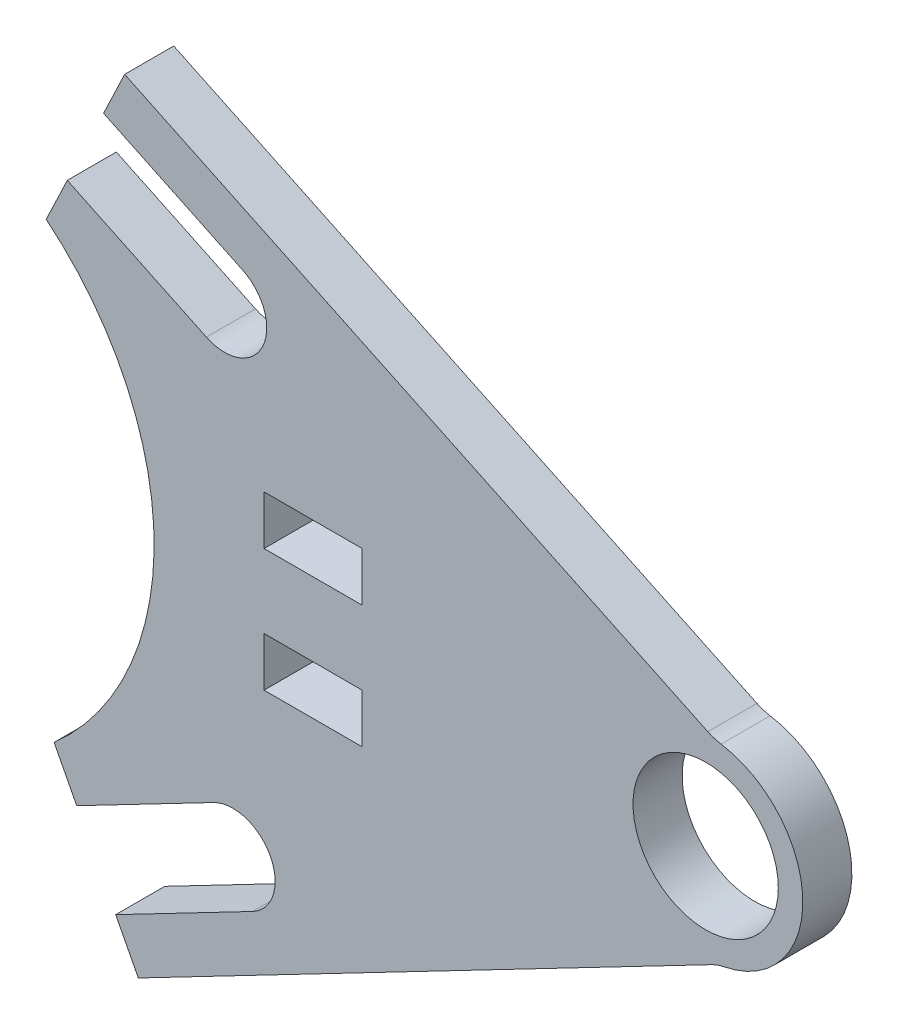
ISO-10303-21;
HEADER;
FILE_DESCRIPTION(('STEP AP214'),'2;1');
FILE_NAME('part.step','',(''),(''),'','','');
FILE_SCHEMA(('AUTOMOTIVE_DESIGN { 1 0 10303 214 1 1 1 1 }'));
ENDSEC;
DATA;
#1=APPLICATION_CONTEXT('core data for automotive mechanical design processes');
#2=APPLICATION_PROTOCOL_DEFINITION('international standard','automotive_design',2000,#1);
#3=PRODUCT_CONTEXT('',#1,'mechanical');
#4=PRODUCT('Part','Part','',(#3));
#5=PRODUCT_RELATED_PRODUCT_CATEGORY('part','',(#4));
#6=PRODUCT_DEFINITION_FORMATION('','',#4);
#7=PRODUCT_DEFINITION_CONTEXT('part definition',#1,'design');
#8=PRODUCT_DEFINITION('design','',#6,#7);
#9=PRODUCT_DEFINITION_SHAPE('','',#8);
#10=(LENGTH_UNIT() NAMED_UNIT(*) SI_UNIT(.MILLI.,.METRE.));
#11=(NAMED_UNIT(*) PLANE_ANGLE_UNIT() SI_UNIT($,.RADIAN.));
#12=(NAMED_UNIT(*) SI_UNIT($,.STERADIAN.) SOLID_ANGLE_UNIT());
#13=UNCERTAINTY_MEASURE_WITH_UNIT(LENGTH_MEASURE(1.E-05),#10,'distance_accuracy_value','');
#14=(GEOMETRIC_REPRESENTATION_CONTEXT(3) GLOBAL_UNCERTAINTY_ASSIGNED_CONTEXT((#13)) GLOBAL_UNIT_ASSIGNED_CONTEXT((#10,
#11,#12)) REPRESENTATION_CONTEXT('',''));
#15=CARTESIAN_POINT('',(0.,0.,0.));
#16=DIRECTION('',(0.,0.,1.));
#17=DIRECTION('',(1.,0.,0.));
#18=AXIS2_PLACEMENT_3D('',#15,#16,#17);
#19=CARTESIAN_POINT('',(-263.267957860914,-136.942631346935,3.175));
#20=DIRECTION('',(-0.887157078497159,-0.461467569903224,0.));
#21=DIRECTION('',(0.461467569903224,-0.887157078497159,0.));
#22=AXIS2_PLACEMENT_3D('',#19,#20,#21);
#23=PLANE('',#22);
#24=DIRECTION('',(-0.461467569903224,0.887157078497159,0.));
#25=VECTOR('',#24,1.);
#26=CARTESIAN_POINT('',(-263.267957860914,-136.942631346935,-3.175));
#27=LINE('',#26,#25);
#28=CARTESIAN_POINT('',(499.974916445738,-1604.25336500405,-3.175));
#29=VERTEX_POINT('',#28);
#30=CARTESIAN_POINT('',(497.044597376853,-1598.61991755559,-3.175));
#31=VERTEX_POINT('',#30);
#32=EDGE_CURVE('E248',#29,#31,#27,.T.);
#33=ORIENTED_EDGE('',*,*,#32,.F.);
#34=DIRECTION('',(0.,0.,-1.));
#35=VECTOR('',#34,1.);
#36=CARTESIAN_POINT('',(499.974916445738,-1604.25336500405,3.175));
#37=LINE('',#36,#35);
#38=CARTESIAN_POINT('',(499.974916445738,-1604.25336500405,3.175));
#39=VERTEX_POINT('',#38);
#40=EDGE_CURVE('E431',#39,#29,#37,.T.);
#41=ORIENTED_EDGE('',*,*,#40,.F.);
#42=DIRECTION('',(-0.461467569903224,0.887157078497159,0.));
#43=VECTOR('',#42,1.);
#44=CARTESIAN_POINT('',(-263.267957860914,-136.942631346935,3.175));
#45=LINE('',#44,#43);
#46=CARTESIAN_POINT('',(497.044597376853,-1598.61991755559,3.175));
#47=VERTEX_POINT('',#46);
#48=EDGE_CURVE('E295',#39,#47,#45,.T.);
#49=ORIENTED_EDGE('',*,*,#48,.T.);
#50=DIRECTION('',(0.,0.,-1.));
#51=VECTOR('',#50,1.);
#52=CARTESIAN_POINT('',(497.044597376853,-1598.61991755559,3.175));
#53=LINE('',#52,#51);
#54=EDGE_CURVE('E434',#47,#31,#53,.T.);
#55=ORIENTED_EDGE('',*,*,#54,.T.);
#56=EDGE_LOOP('',(#33,#41,#49,#55));
#57=FACE_BOUND('',#56,.T.);
#58=ADVANCED_FACE('F40',(#57),#23,.T.);
#59=CARTESIAN_POINT('',(763.242874306629,-1467.31073365713,3.175));
#60=DIRECTION('',(0.461467569903208,-0.887157078497166,0.));
#61=DIRECTION('',(0.887157078497167,0.461467569903209,0.));
#62=AXIS2_PLACEMENT_3D('',#59,#60,#61);
#63=PLANE('',#62);
#64=DIRECTION('',(-0.887157078497166,-0.461467569903208,0.));
#65=VECTOR('',#64,1.);
#66=CARTESIAN_POINT('',(763.242874306629,-1467.31073365713,-3.175));
#67=LINE('',#66,#65);
#68=CARTESIAN_POINT('',(517.663941433873,-1595.05216312776,-3.175));
#69=VERTEX_POINT('',#68);
#70=EDGE_CURVE('E350',#69,#29,#67,.T.);
#71=ORIENTED_EDGE('',*,*,#70,.F.);
#72=DIRECTION('',(0.,0.,-1.));
#73=VECTOR('',#72,1.);
#74=CARTESIAN_POINT('',(517.663941433873,-1595.05216312776,3.175));
#75=LINE('',#74,#73);
#76=CARTESIAN_POINT('',(517.663941433873,-1595.05216312776,3.175));
#77=VERTEX_POINT('',#76);
#78=EDGE_CURVE('E428',#77,#69,#75,.T.);
#79=ORIENTED_EDGE('',*,*,#78,.F.);
#80=DIRECTION('',(-0.887157078497166,-0.461467569903208,0.));
#81=VECTOR('',#80,1.);
#82=CARTESIAN_POINT('',(763.242874306629,-1467.31073365713,3.175));
#83=LINE('',#82,#81);
#84=EDGE_CURVE('E299',#77,#39,#83,.T.);
#85=ORIENTED_EDGE('',*,*,#84,.T.);
#86=ORIENTED_EDGE('',*,*,#40,.T.);
#87=EDGE_LOOP('',(#71,#79,#85,#86));
#88=FACE_BOUND('',#87,.T.);
#89=ADVANCED_FACE('F525',(#88),#63,.T.);
#90=CARTESIAN_POINT('',(520.184015833114,-1599.89692793343,3.175));
#91=DIRECTION('',(0.,0.,-1.));
#92=DIRECTION('',(-1.,0.,0.));
#93=AXIS2_PLACEMENT_3D('',#90,#91,#92);
#94=CYLINDRICAL_SURFACE('',#93,5.46099999999947);
#95=CARTESIAN_POINT('',(520.184015833114,-1599.89692793343,-3.175));
#96=DIRECTION('',(0.,0.,1.));
#97=DIRECTION('',(1.,0.,0.));
#98=AXIS2_PLACEMENT_3D('',#95,#96,#97);
#99=CIRCLE('',#98,5.46099999999947);
#100=CARTESIAN_POINT('',(522.704090232356,-1604.7416927391,-3.175));
#101=VERTEX_POINT('',#100);
#102=EDGE_CURVE('E354',#69,#101,#99,.F.);
#103=ORIENTED_EDGE('',*,*,#102,.T.);
#104=DIRECTION('',(0.,0.,-1.));
#105=VECTOR('',#104,1.);
#106=CARTESIAN_POINT('',(522.704090232356,-1604.7416927391,3.175));
#107=LINE('',#106,#105);
#108=CARTESIAN_POINT('',(522.704090232356,-1604.7416927391,3.175));
#109=VERTEX_POINT('',#108);
#110=EDGE_CURVE('E424',#109,#101,#107,.T.);
#111=ORIENTED_EDGE('',*,*,#110,.F.);
#112=CARTESIAN_POINT('',(520.184015833114,-1599.89692793343,3.175));
#113=DIRECTION('',(0.,0.,1.));
#114=DIRECTION('',(1.,0.,0.));
#115=AXIS2_PLACEMENT_3D('',#112,#113,#114);
#116=CIRCLE('',#115,5.46099999999947);
#117=EDGE_CURVE('E304',#77,#109,#116,.F.);
#118=ORIENTED_EDGE('',*,*,#117,.F.);
#119=ORIENTED_EDGE('',*,*,#78,.T.);
#120=EDGE_LOOP('',(#103,#111,#118,#119));
#121=FACE_BOUND('',#120,.T.);
#122=ADVANCED_FACE('F531',(#121),#94,.F.);
#123=CARTESIAN_POINT('',(768.283023105145,-1477.00026326845,3.175));
#124=DIRECTION('',(0.461467569903231,-0.887157078497155,0.));
#125=DIRECTION('',(0.887157078497155,0.461467569903231,0.));
#126=AXIS2_PLACEMENT_3D('',#123,#124,#125);
#127=PLANE('',#126);
#128=DIRECTION('',(-0.887157078497155,-0.461467569903231,0.));
#129=VECTOR('',#128,1.);
#130=CARTESIAN_POINT('',(768.283023105145,-1477.00026326845,-3.175));
#131=LINE('',#130,#129);
#132=CARTESIAN_POINT('',(505.015065244221,-1613.94289461539,-3.175));
#133=VERTEX_POINT('',#132);
#134=EDGE_CURVE('E357',#101,#133,#131,.T.);
#135=ORIENTED_EDGE('',*,*,#134,.T.);
#136=DIRECTION('',(0.,0.,-1.));
#137=VECTOR('',#136,1.);
#138=CARTESIAN_POINT('',(505.015065244221,-1613.94289461539,3.175));
#139=LINE('',#138,#137);
#140=CARTESIAN_POINT('',(505.015065244221,-1613.94289461539,3.175));
#141=VERTEX_POINT('',#140);
#142=EDGE_CURVE('E420',#141,#133,#139,.T.);
#143=ORIENTED_EDGE('',*,*,#142,.F.);
#144=DIRECTION('',(-0.887157078497155,-0.461467569903231,0.));
#145=VECTOR('',#144,1.);
#146=CARTESIAN_POINT('',(768.283023105145,-1477.00026326845,3.175));
#147=LINE('',#146,#145);
#148=EDGE_CURVE('E307',#109,#141,#147,.T.);
#149=ORIENTED_EDGE('',*,*,#148,.F.);
#150=ORIENTED_EDGE('',*,*,#110,.T.);
#151=EDGE_LOOP('',(#135,#143,#149,#150));
#152=FACE_BOUND('',#151,.T.);
#153=ADVANCED_FACE('F535',(#152),#127,.F.);
#154=CARTESIAN_POINT('',(-263.267957860903,-136.942631346927,3.175));
#155=DIRECTION('',(0.887157078497162,0.461467569903217,0.));
#156=DIRECTION('',(-0.461467569903217,0.887157078497162,0.));
#157=AXIS2_PLACEMENT_3D('',#154,#155,#156);
#158=PLANE('',#157);
#159=DIRECTION('',(0.461467569903217,-0.887157078497162,0.));
#160=VECTOR('',#159,1.);
#161=CARTESIAN_POINT('',(-263.267957860903,-136.942631346927,-3.175));
#162=LINE('',#161,#160);
#163=CARTESIAN_POINT('',(507.945384313107,-1619.57634206385,-3.175));
#164=VERTEX_POINT('',#163);
#165=EDGE_CURVE('E360',#133,#164,#162,.T.);
#166=ORIENTED_EDGE('',*,*,#165,.T.);
#167=DIRECTION('',(0.,0.,-1.));
#168=VECTOR('',#167,1.);
#169=CARTESIAN_POINT('',(507.945384313107,-1619.57634206385,3.175));
#170=LINE('',#169,#168);
#171=CARTESIAN_POINT('',(507.945384313107,-1619.57634206385,3.175));
#172=VERTEX_POINT('',#171);
#173=EDGE_CURVE('E416',#172,#164,#170,.T.);
#174=ORIENTED_EDGE('',*,*,#173,.F.);
#175=DIRECTION('',(0.461467569903217,-0.887157078497162,0.));
#176=VECTOR('',#175,1.);
#177=CARTESIAN_POINT('',(-263.267957860903,-136.942631346927,3.175));
#178=LINE('',#177,#176);
#179=EDGE_CURVE('E310',#141,#172,#178,.T.);
#180=ORIENTED_EDGE('',*,*,#179,.F.);
#181=ORIENTED_EDGE('',*,*,#142,.T.);
#182=EDGE_LOOP('',(#166,#174,#180,#181));
#183=FACE_BOUND('',#182,.T.);
#184=ADVANCED_FACE('F538',(#183),#158,.F.);
#185=CARTESIAN_POINT('',(771.21334217402,-1482.63371071691,3.175));
#186=DIRECTION('',(-0.461467569903223,0.887157078497159,0.));
#187=DIRECTION('',(-0.887157078497159,-0.461467569903223,0.));
#188=AXIS2_PLACEMENT_3D('',#185,#186,#187);
#189=PLANE('',#188);
#190=DIRECTION('',(0.887157078497159,0.461467569903223,0.));
#191=VECTOR('',#190,1.);
#192=CARTESIAN_POINT('',(771.21334217402,-1482.63371071691,-3.175));
#193=LINE('',#192,#191);
#194=CARTESIAN_POINT('',(582.09767576583,-1581.00495648982,-3.175));
#195=VERTEX_POINT('',#194);
#196=EDGE_CURVE('E363',#164,#195,#193,.T.);
#197=ORIENTED_EDGE('',*,*,#196,.T.);
#198=DIRECTION('',(0.,0.,1.));
#199=VECTOR('',#198,1.);
#200=CARTESIAN_POINT('',(582.09767576583,-1581.00495648982,3.175));
#201=LINE('',#200,#199);
#202=CARTESIAN_POINT('',(582.09767576583,-1581.00495648982,3.175));
#203=VERTEX_POINT('',#202);
#204=EDGE_CURVE('E455',#195,#203,#201,.T.);
#205=ORIENTED_EDGE('',*,*,#204,.T.);
#206=DIRECTION('',(0.887157078497159,0.461467569903223,0.));
#207=VECTOR('',#206,1.);
#208=CARTESIAN_POINT('',(771.21334217402,-1482.63371071691,3.175));
#209=LINE('',#208,#207);
#210=EDGE_CURVE('E313',#172,#203,#209,.T.);
#211=ORIENTED_EDGE('',*,*,#210,.F.);
#212=ORIENTED_EDGE('',*,*,#173,.T.);
#213=EDGE_LOOP('',(#197,#205,#211,#212));
#214=FACE_BOUND('',#213,.T.);
#215=ADVANCED_FACE('F473',(#214),#189,.F.);
#216=CARTESIAN_POINT('',(581.363255123357,-1568.07366284533,3.175));
#217=DIRECTION('',(0.,0.,-1.));
#218=DIRECTION('',(-1.,0.,0.));
#219=AXIS2_PLACEMENT_3D('',#216,#217,#218);
#220=CYLINDRICAL_SURFACE('',#219,12.5729999999999);
#221=CARTESIAN_POINT('',(581.363255123357,-1568.07366284533,-3.175));
#222=DIRECTION('',(0.,0.,1.));
#223=DIRECTION('',(1.,0.,0.));
#224=AXIS2_PLACEMENT_3D('',#221,#222,#223);
#225=CIRCLE('',#224,12.5729999999999);
#226=CARTESIAN_POINT('',(583.798216408085,-1580.40862504803,-3.175));
#227=VERTEX_POINT('',#226);
#228=CARTESIAN_POINT('',(583.362228805199,-1555.66058775415,-3.175));
#229=VERTEX_POINT('',#228);
#230=EDGE_CURVE('E367',#227,#229,#225,.T.);
#231=ORIENTED_EDGE('',*,*,#230,.T.);
#232=DIRECTION('',(0.,0.,-1.));
#233=VECTOR('',#232,1.);
#234=CARTESIAN_POINT('',(583.362228805199,-1555.66058775415,3.175));
#235=LINE('',#234,#233);
#236=CARTESIAN_POINT('',(583.362228805199,-1555.66058775415,3.175));
#237=VERTEX_POINT('',#236);
#238=EDGE_CURVE('E452',#229,#237,#235,.F.);
#239=ORIENTED_EDGE('',*,*,#238,.T.);
#240=CARTESIAN_POINT('',(581.363255123357,-1568.07366284533,3.175));
#241=DIRECTION('',(0.,0.,1.));
#242=DIRECTION('',(1.,0.,0.));
#243=AXIS2_PLACEMENT_3D('',#240,#241,#242);
#244=CIRCLE('',#243,12.5729999999999);
#245=CARTESIAN_POINT('',(583.798216408085,-1580.40862504803,3.175));
#246=VERTEX_POINT('',#245);
#247=EDGE_CURVE('E317',#246,#237,#244,.T.);
#248=ORIENTED_EDGE('',*,*,#247,.F.);
#249=DIRECTION('',(0.,0.,-1.));
#250=VECTOR('',#249,1.);
#251=CARTESIAN_POINT('',(583.798216408085,-1580.40862504803,3.175));
#252=LINE('',#251,#250);
#253=EDGE_CURVE('E448',#246,#227,#252,.T.);
#254=ORIENTED_EDGE('',*,*,#253,.T.);
#255=EDGE_LOOP('',(#231,#239,#248,#254));
#256=FACE_BOUND('',#255,.T.);
#257=ADVANCED_FACE('F483',(#256),#220,.T.);
#258=CARTESIAN_POINT('',(-496.139932614072,-1041.8964186045,3.175));
#259=DIRECTION('',(0.42993271924413,0.902860928894007,0.));
#260=DIRECTION('',(-0.902860928894007,0.42993271924413,0.));
#261=AXIS2_PLACEMENT_3D('',#258,#259,#260);
#262=PLANE('',#261);
#263=DIRECTION('',(0.902860928894007,-0.42993271924413,0.));
#264=VECTOR('',#263,1.);
#265=CARTESIAN_POINT('',(-496.139932614072,-1041.8964186045,3.175));
#266=LINE('',#265,#264);
#267=CARTESIAN_POINT('',(506.176853891672,-1519.18895367336,3.175));
#268=VERTEX_POINT('',#267);
#269=CARTESIAN_POINT('',(581.641738705597,-1555.1245248086,3.175));
#270=VERTEX_POINT('',#269);
#271=EDGE_CURVE('E321',#268,#270,#266,.T.);
#272=ORIENTED_EDGE('',*,*,#271,.T.);
#273=DIRECTION('',(0.,0.,-1.));
#274=VECTOR('',#273,1.);
#275=CARTESIAN_POINT('',(581.641738705596,-1555.1245248086,3.175));
#276=LINE('',#275,#274);
#277=CARTESIAN_POINT('',(581.641738705597,-1555.1245248086,-3.175));
#278=VERTEX_POINT('',#277);
#279=EDGE_CURVE('E444',#270,#278,#276,.T.);
#280=ORIENTED_EDGE('',*,*,#279,.T.);
#281=DIRECTION('',(0.902860928894007,-0.42993271924413,0.));
#282=VECTOR('',#281,1.);
#283=CARTESIAN_POINT('',(-496.139932614072,-1041.8964186045,-3.175));
#284=LINE('',#283,#282);
#285=CARTESIAN_POINT('',(506.176853891672,-1519.18895367336,-3.175));
#286=VERTEX_POINT('',#285);
#287=EDGE_CURVE('E371',#286,#278,#284,.T.);
#288=ORIENTED_EDGE('',*,*,#287,.F.);
#289=DIRECTION('',(0.,0.,-1.));
#290=VECTOR('',#289,1.);
#291=CARTESIAN_POINT('',(506.176853891672,-1519.18895367336,3.175));
#292=LINE('',#291,#290);
#293=EDGE_CURVE('E413',#268,#286,#292,.T.);
#294=ORIENTED_EDGE('',*,*,#293,.F.);
#295=EDGE_LOOP('',(#272,#280,#288,#294));
#296=FACE_BOUND('',#295,.T.);
#297=ADVANCED_FACE('F491',(#296),#262,.T.);
#298=CARTESIAN_POINT('',(1002.31678650575,-477.292535068869,3.175));
#299=DIRECTION('',(-0.902860928894006,0.429932719244131,0.));
#300=DIRECTION('',(-0.429932719244131,-0.902860928894006,0.));
#301=AXIS2_PLACEMENT_3D('',#298,#299,#300);
#302=PLANE('',#301);
#303=DIRECTION('',(0.429932719244131,0.902860928894006,0.));
#304=VECTOR('',#303,1.);
#305=CARTESIAN_POINT('',(1002.31678650575,-477.292535068869,-3.175));
#306=LINE('',#305,#304);
#307=CARTESIAN_POINT('',(503.446781124472,-1524.92212057184,-3.175));
#308=VERTEX_POINT('',#307);
#309=EDGE_CURVE('E375',#308,#286,#306,.T.);
#310=ORIENTED_EDGE('',*,*,#309,.F.);
#311=DIRECTION('',(0.,0.,-1.));
#312=VECTOR('',#311,1.);
#313=CARTESIAN_POINT('',(503.446781124472,-1524.92212057184,3.175));
#314=LINE('',#313,#312);
#315=CARTESIAN_POINT('',(503.446781124472,-1524.92212057184,3.175));
#316=VERTEX_POINT('',#315);
#317=EDGE_CURVE('E410',#316,#308,#314,.T.);
#318=ORIENTED_EDGE('',*,*,#317,.F.);
#319=DIRECTION('',(0.429932719244131,0.902860928894006,0.));
#320=VECTOR('',#319,1.);
#321=CARTESIAN_POINT('',(1002.31678650575,-477.292535068869,3.175));
#322=LINE('',#321,#320);
#323=EDGE_CURVE('E325',#316,#268,#322,.T.);
#324=ORIENTED_EDGE('',*,*,#323,.T.);
#325=ORIENTED_EDGE('',*,*,#293,.T.);
#326=EDGE_LOOP('',(#310,#318,#324,#325));
#327=FACE_BOUND('',#326,.T.);
#328=ADVANCED_FACE('F495',(#327),#302,.T.);
#329=CARTESIAN_POINT('',(-498.870005381264,-1047.629585503,3.175));
#330=DIRECTION('',(-0.429932719244116,-0.902860928894013,0.));
#331=DIRECTION('',(0.902860928894013,-0.429932719244116,0.));
#332=AXIS2_PLACEMENT_3D('',#329,#330,#331);
#333=PLANE('',#332);
#334=DIRECTION('',(-0.902860928894013,0.429932719244116,0.));
#335=VECTOR('',#334,1.);
#336=CARTESIAN_POINT('',(-498.870005381264,-1047.629585503,-3.175));
#337=LINE('',#336,#335);
#338=CARTESIAN_POINT('',(521.448925185669,-1533.49454906084,-3.175));
#339=VERTEX_POINT('',#338);
#340=EDGE_CURVE('E379',#339,#308,#337,.T.);
#341=ORIENTED_EDGE('',*,*,#340,.F.);
#342=DIRECTION('',(0.,0.,-1.));
#343=VECTOR('',#342,1.);
#344=CARTESIAN_POINT('',(521.448925185669,-1533.49454906084,3.175));
#345=LINE('',#344,#343);
#346=CARTESIAN_POINT('',(521.448925185669,-1533.49454906084,3.175));
#347=VERTEX_POINT('',#346);
#348=EDGE_CURVE('E407',#347,#339,#345,.T.);
#349=ORIENTED_EDGE('',*,*,#348,.F.);
#350=DIRECTION('',(-0.902860928894013,0.429932719244116,0.));
#351=VECTOR('',#350,1.);
#352=CARTESIAN_POINT('',(-498.870005381264,-1047.629585503,3.175));
#353=LINE('',#352,#351);
#354=EDGE_CURVE('E329',#347,#316,#353,.T.);
#355=ORIENTED_EDGE('',*,*,#354,.T.);
#356=ORIENTED_EDGE('',*,*,#317,.T.);
#357=EDGE_LOOP('',(#341,#349,#355,#356));
#358=FACE_BOUND('',#357,.T.);
#359=ADVANCED_FACE('F499',(#358),#333,.T.);
#360=CARTESIAN_POINT('',(519.101062605876,-1538.42507259353,3.175));
#361=DIRECTION('',(0.,0.,-1.));
#362=DIRECTION('',(-1.,0.,0.));
#363=AXIS2_PLACEMENT_3D('',#360,#361,#362);
#364=CYLINDRICAL_SURFACE('',#363,5.46100000000039);
#365=CARTESIAN_POINT('',(519.101062605876,-1538.42507259353,-3.175));
#366=DIRECTION('',(0.,0.,1.));
#367=DIRECTION('',(1.,0.,0.));
#368=AXIS2_PLACEMENT_3D('',#365,#366,#367);
#369=CIRCLE('',#368,5.46100000000039);
#370=CARTESIAN_POINT('',(516.753200026084,-1543.35559612622,-3.175));
#371=VERTEX_POINT('',#370);
#372=EDGE_CURVE('E383',#339,#371,#369,.F.);
#373=ORIENTED_EDGE('',*,*,#372,.T.);
#374=DIRECTION('',(0.,0.,-1.));
#375=VECTOR('',#374,1.);
#376=CARTESIAN_POINT('',(516.753200026084,-1543.35559612622,3.175));
#377=LINE('',#376,#375);
#378=CARTESIAN_POINT('',(516.753200026084,-1543.35559612622,3.175));
#379=VERTEX_POINT('',#378);
#380=EDGE_CURVE('E403',#379,#371,#377,.T.);
#381=ORIENTED_EDGE('',*,*,#380,.F.);
#382=CARTESIAN_POINT('',(519.101062605876,-1538.42507259353,3.175));
#383=DIRECTION('',(0.,0.,1.));
#384=DIRECTION('',(1.,0.,0.));
#385=AXIS2_PLACEMENT_3D('',#382,#383,#384);
#386=CIRCLE('',#385,5.46100000000039);
#387=EDGE_CURVE('E333',#347,#379,#386,.F.);
#388=ORIENTED_EDGE('',*,*,#387,.F.);
#389=ORIENTED_EDGE('',*,*,#348,.T.);
#390=EDGE_LOOP('',(#373,#381,#388,#389));
#391=FACE_BOUND('',#390,.T.);
#392=ADVANCED_FACE('F504',(#391),#364,.F.);
#393=CARTESIAN_POINT('',(-503.56573054087,-1057.49063256832,3.175));
#394=DIRECTION('',(-0.42993271924415,-0.902860928893997,0.));
#395=DIRECTION('',(0.902860928893997,-0.42993271924415,0.));
#396=AXIS2_PLACEMENT_3D('',#393,#394,#395);
#397=PLANE('',#396);
#398=DIRECTION('',(-0.902860928893997,0.42993271924415,0.));
#399=VECTOR('',#398,1.);
#400=CARTESIAN_POINT('',(-503.56573054087,-1057.49063256832,-3.175));
#401=LINE('',#400,#399);
#402=CARTESIAN_POINT('',(498.751055964887,-1534.78316763722,-3.175));
#403=VERTEX_POINT('',#402);
#404=EDGE_CURVE('E386',#371,#403,#401,.T.);
#405=ORIENTED_EDGE('',*,*,#404,.T.);
#406=DIRECTION('',(0.,0.,-1.));
#407=VECTOR('',#406,1.);
#408=CARTESIAN_POINT('',(498.751055964887,-1534.78316763722,3.175));
#409=LINE('',#408,#407);
#410=CARTESIAN_POINT('',(498.751055964887,-1534.78316763722,3.175));
#411=VERTEX_POINT('',#410);
#412=EDGE_CURVE('E399',#411,#403,#409,.T.);
#413=ORIENTED_EDGE('',*,*,#412,.F.);
#414=DIRECTION('',(-0.902860928893997,0.42993271924415,0.));
#415=VECTOR('',#414,1.);
#416=CARTESIAN_POINT('',(-503.56573054087,-1057.49063256832,3.175));
#417=LINE('',#416,#415);
#418=EDGE_CURVE('E336',#379,#411,#417,.T.);
#419=ORIENTED_EDGE('',*,*,#418,.F.);
#420=ORIENTED_EDGE('',*,*,#380,.T.);
#421=EDGE_LOOP('',(#405,#413,#419,#420));
#422=FACE_BOUND('',#421,.T.);
#423=ADVANCED_FACE('F510',(#422),#397,.F.);
#424=CARTESIAN_POINT('',(1002.31678650574,-477.292535068858,3.175));
#425=DIRECTION('',(0.902860928894009,-0.429932719244124,0.));
#426=DIRECTION('',(0.429932719244124,0.902860928894009,0.));
#427=AXIS2_PLACEMENT_3D('',#424,#425,#426);
#428=PLANE('',#427);
#429=DIRECTION('',(-0.429932719244124,-0.902860928894009,0.));
#430=VECTOR('',#429,1.);
#431=CARTESIAN_POINT('',(1002.31678650574,-477.292535068858,-3.175));
#432=LINE('',#431,#430);
#433=CARTESIAN_POINT('',(496.020983197687,-1540.5163345357,-3.175));
#434=VERTEX_POINT('',#433);
#435=EDGE_CURVE('E389',#403,#434,#432,.T.);
#436=ORIENTED_EDGE('',*,*,#435,.T.);
#437=DIRECTION('',(0.,0.,-1.));
#438=VECTOR('',#437,1.);
#439=CARTESIAN_POINT('',(496.020983197687,-1540.5163345357,3.175));
#440=LINE('',#439,#438);
#441=CARTESIAN_POINT('',(496.020983197687,-1540.5163345357,3.175));
#442=VERTEX_POINT('',#441);
#443=EDGE_CURVE('E346',#442,#434,#440,.T.);
#444=ORIENTED_EDGE('',*,*,#443,.F.);
#445=DIRECTION('',(-0.429932719244124,-0.902860928894009,0.));
#446=VECTOR('',#445,1.);
#447=CARTESIAN_POINT('',(1002.31678650574,-477.292535068858,3.175));
#448=LINE('',#447,#446);
#449=EDGE_CURVE('E339',#411,#442,#448,.T.);
#450=ORIENTED_EDGE('',*,*,#449,.F.);
#451=ORIENTED_EDGE('',*,*,#412,.T.);
#452=EDGE_LOOP('',(#436,#444,#450,#451));
#453=FACE_BOUND('',#452,.T.);
#454=ADVANCED_FACE('F514',(#453),#428,.F.);
#455=CARTESIAN_POINT('',(581.363255123357,-1568.07366284533,3.175));
#456=DIRECTION('',(0.,0.,-1.));
#457=DIRECTION('',(-1.,0.,0.));
#458=AXIS2_PLACEMENT_3D('',#455,#456,#457);
#459=CYLINDRICAL_SURFACE('',#458,9.39800000000004);
#460=CARTESIAN_POINT('',(581.363255123357,-1568.07366284533,3.175));
#461=DIRECTION('',(0.,0.,1.));
#462=DIRECTION('',(1.,0.,0.));
#463=AXIS2_PLACEMENT_3D('',#460,#461,#462);
#464=CIRCLE('',#463,9.39800000000004);
#465=CARTESIAN_POINT('',(590.761255123357,-1568.07366284533,3.175));
#466=VERTEX_POINT('',#465);
#467=EDGE_CURVE('E342',#466,#466,#464,.T.);
#468=ORIENTED_EDGE('',*,*,#467,.T.);
#469=EDGE_LOOP('',(#468));
#470=FACE_BOUND('',#469,.T.);
#471=CARTESIAN_POINT('',(581.363255123357,-1568.07366284533,-3.175));
#472=DIRECTION('',(0.,0.,1.));
#473=DIRECTION('',(1.,0.,0.));
#474=AXIS2_PLACEMENT_3D('',#471,#472,#473);
#475=CIRCLE('',#474,9.39800000000004);
#476=CARTESIAN_POINT('',(590.761255123357,-1568.07366284533,-3.175));
#477=VERTEX_POINT('',#476);
#478=EDGE_CURVE('E300',#477,#477,#475,.T.);
#479=ORIENTED_EDGE('',*,*,#478,.F.);
#480=EDGE_LOOP('',(#479));
#481=FACE_BOUND('',#480,.T.);
#482=ADVANCED_FACE('F578',(#470,#481),#459,.F.);
#483=CARTESIAN_POINT('',(0.,0.,3.175));
#484=DIRECTION('',(0.,0.,1.));
#485=DIRECTION('',(1.,0.,0.));
#486=AXIS2_PLACEMENT_3D('',#483,#484,#485);
#487=PLANE('',#486);
#488=DIRECTION('',(0.,1.,0.));
#489=VECTOR('',#488,1.);
#490=CARTESIAN_POINT('',(536.913255123357,-1556.96116284533,3.175));
#491=LINE('',#490,#489);
#492=CARTESIAN_POINT('',(536.913255123357,-1563.31116284533,3.175));
#493=VERTEX_POINT('',#492);
#494=CARTESIAN_POINT('',(536.913255123357,-1556.96116284533,3.175));
#495=VERTEX_POINT('',#494);
#496=EDGE_CURVE('E56',#493,#495,#491,.T.);
#497=ORIENTED_EDGE('',*,*,#496,.F.);
#498=DIRECTION('',(1.,0.,0.));
#499=VECTOR('',#498,1.);
#500=CARTESIAN_POINT('',(536.913255123357,-1563.31116284533,3.175));
#501=LINE('',#500,#499);
#502=CARTESIAN_POINT('',(524.213255123357,-1563.31116284533,3.175));
#503=VERTEX_POINT('',#502);
#504=EDGE_CURVE('E225',#503,#493,#501,.T.);
#505=ORIENTED_EDGE('',*,*,#504,.F.);
#506=DIRECTION('',(0.,-1.,0.));
#507=VECTOR('',#506,1.);
#508=CARTESIAN_POINT('',(524.213255123357,-1563.31116284533,3.175));
#509=LINE('',#508,#507);
#510=CARTESIAN_POINT('',(524.213255123357,-1556.96116284533,3.175));
#511=VERTEX_POINT('',#510);
#512=EDGE_CURVE('E229',#511,#503,#509,.T.);
#513=ORIENTED_EDGE('',*,*,#512,.F.);
#514=DIRECTION('',(-1.,0.,0.));
#515=VECTOR('',#514,1.);
#516=CARTESIAN_POINT('',(524.213255123357,-1556.96116284533,3.175));
#517=LINE('',#516,#515);
#518=EDGE_CURVE('E238',#495,#511,#517,.T.);
#519=ORIENTED_EDGE('',*,*,#518,.F.);
#520=EDGE_LOOP('',(#497,#505,#513,#519));
#521=FACE_BOUND('',#520,.T.);
#522=DIRECTION('',(0.,-1.,0.));
#523=VECTOR('',#522,1.);
#524=CARTESIAN_POINT('',(524.213255123357,-1572.83616284533,3.175));
#525=LINE('',#524,#523);
#526=CARTESIAN_POINT('',(524.213255123357,-1572.83616284533,3.175));
#527=VERTEX_POINT('',#526);
#528=CARTESIAN_POINT('',(524.213255123357,-1579.18616284533,3.175));
#529=VERTEX_POINT('',#528);
#530=EDGE_CURVE('E64',#527,#529,#525,.T.);
#531=ORIENTED_EDGE('',*,*,#530,.F.);
#532=DIRECTION('',(-1.,0.,0.));
#533=VECTOR('',#532,1.);
#534=CARTESIAN_POINT('',(536.913255123357,-1572.83616284533,3.175));
#535=LINE('',#534,#533);
#536=CARTESIAN_POINT('',(536.913255123357,-1572.83616284533,3.175));
#537=VERTEX_POINT('',#536);
#538=EDGE_CURVE('E259',#537,#527,#535,.T.);
#539=ORIENTED_EDGE('',*,*,#538,.F.);
#540=DIRECTION('',(0.,1.,0.));
#541=VECTOR('',#540,1.);
#542=CARTESIAN_POINT('',(536.913255123357,-1579.18616284533,3.175));
#543=LINE('',#542,#541);
#544=CARTESIAN_POINT('',(536.913255123357,-1579.18616284533,3.175));
#545=VERTEX_POINT('',#544);
#546=EDGE_CURVE('E278',#545,#537,#543,.T.);
#547=ORIENTED_EDGE('',*,*,#546,.F.);
#548=DIRECTION('',(1.,0.,0.));
#549=VECTOR('',#548,1.);
#550=CARTESIAN_POINT('',(524.213255123357,-1579.18616284533,3.175));
#551=LINE('',#550,#549);
#552=EDGE_CURVE('E274',#529,#545,#551,.T.);
#553=ORIENTED_EDGE('',*,*,#552,.F.);
#554=EDGE_LOOP('',(#531,#539,#547,#553));
#555=FACE_BOUND('',#554,.T.);
#556=ORIENTED_EDGE('',*,*,#449,.T.);
#557=CARTESIAN_POINT('',(471.892314904028,-1570.00221872415,3.175));
#558=DIRECTION('',(0.,0.,1.));
#559=DIRECTION('',(1.,0.,0.));
#560=AXIS2_PLACEMENT_3D('',#557,#558,#559);
#561=CIRCLE('',#560,38.1);
#562=EDGE_CURVE('E441',#442,#47,#561,.F.);
#563=ORIENTED_EDGE('',*,*,#562,.T.);
#564=ORIENTED_EDGE('',*,*,#48,.F.);
#565=ORIENTED_EDGE('',*,*,#84,.F.);
#566=ORIENTED_EDGE('',*,*,#117,.T.);
#567=ORIENTED_EDGE('',*,*,#148,.T.);
#568=ORIENTED_EDGE('',*,*,#179,.T.);
#569=ORIENTED_EDGE('',*,*,#210,.T.);
#570=CARTESIAN_POINT('',(585.027994834716,-1586.63840393828,3.175));
#571=DIRECTION('',(0.,0.,1.));
#572=DIRECTION('',(1.,0.,0.));
#573=AXIS2_PLACEMENT_3D('',#570,#571,#572);
#574=CIRCLE('',#573,6.35);
#575=EDGE_CURVE('E11',#203,#246,#574,.F.);
#576=ORIENTED_EDGE('',*,*,#575,.T.);
#577=ORIENTED_EDGE('',*,*,#247,.T.);
#578=CARTESIAN_POINT('',(584.371811472796,-1549.39135791012,3.175));
#579=DIRECTION('',(0.,0.,1.));
#580=DIRECTION('',(1.,0.,0.));
#581=AXIS2_PLACEMENT_3D('',#578,#579,#580);
#582=CIRCLE('',#581,6.35);
#583=EDGE_CURVE('E461',#237,#270,#582,.F.);
#584=ORIENTED_EDGE('',*,*,#583,.T.);
#585=ORIENTED_EDGE('',*,*,#271,.F.);
#586=ORIENTED_EDGE('',*,*,#323,.F.);
#587=ORIENTED_EDGE('',*,*,#354,.F.);
#588=ORIENTED_EDGE('',*,*,#387,.T.);
#589=ORIENTED_EDGE('',*,*,#418,.T.);
#590=EDGE_LOOP('',(#556,#563,#564,#565,#566,#567,#568,#569,#576,#577,#584,#585,#586,#587,#588,#589));
#591=FACE_BOUND('',#590,.T.);
#592=ORIENTED_EDGE('',*,*,#467,.F.);
#593=EDGE_LOOP('',(#592));
#594=FACE_BOUND('',#593,.T.);
#595=ADVANCED_FACE('F479',(#521,#555,#591,#594),#487,.T.);
#596=CARTESIAN_POINT('',(0.,0.,-3.175));
#597=DIRECTION('',(0.,0.,1.));
#598=DIRECTION('',(1.,0.,0.));
#599=AXIS2_PLACEMENT_3D('',#596,#597,#598);
#600=PLANE('',#599);
#601=DIRECTION('',(1.,0.,0.));
#602=VECTOR('',#601,1.);
#603=CARTESIAN_POINT('',(536.913255123357,-1563.31116284533,-3.175));
#604=LINE('',#603,#602);
#605=CARTESIAN_POINT('',(524.213255123357,-1563.31116284533,-3.175));
#606=VERTEX_POINT('',#605);
#607=CARTESIAN_POINT('',(536.913255123357,-1563.31116284533,-3.175));
#608=VERTEX_POINT('',#607);
#609=EDGE_CURVE('E210',#606,#608,#604,.T.);
#610=ORIENTED_EDGE('',*,*,#609,.T.);
#611=DIRECTION('',(0.,1.,0.));
#612=VECTOR('',#611,1.);
#613=CARTESIAN_POINT('',(536.913255123357,-1556.96116284533,-3.175));
#614=LINE('',#613,#612);
#615=CARTESIAN_POINT('',(536.913255123357,-1556.96116284533,-3.175));
#616=VERTEX_POINT('',#615);
#617=EDGE_CURVE('E203',#608,#616,#614,.T.);
#618=ORIENTED_EDGE('',*,*,#617,.T.);
#619=DIRECTION('',(-1.,0.,0.));
#620=VECTOR('',#619,1.);
#621=CARTESIAN_POINT('',(524.213255123357,-1556.96116284533,-3.175));
#622=LINE('',#621,#620);
#623=CARTESIAN_POINT('',(524.213255123357,-1556.96116284533,-3.175));
#624=VERTEX_POINT('',#623);
#625=EDGE_CURVE('E214',#616,#624,#622,.T.);
#626=ORIENTED_EDGE('',*,*,#625,.T.);
#627=DIRECTION('',(0.,-1.,0.));
#628=VECTOR('',#627,1.);
#629=CARTESIAN_POINT('',(524.213255123357,-1563.31116284533,-3.175));
#630=LINE('',#629,#628);
#631=EDGE_CURVE('E219',#624,#606,#630,.T.);
#632=ORIENTED_EDGE('',*,*,#631,.T.);
#633=EDGE_LOOP('',(#610,#618,#626,#632));
#634=FACE_BOUND('',#633,.T.);
#635=DIRECTION('',(-1.,0.,0.));
#636=VECTOR('',#635,1.);
#637=CARTESIAN_POINT('',(536.913255123357,-1572.83616284533,-3.175));
#638=LINE('',#637,#636);
#639=CARTESIAN_POINT('',(536.913255123357,-1572.83616284533,-3.175));
#640=VERTEX_POINT('',#639);
#641=CARTESIAN_POINT('',(524.213255123357,-1572.83616284533,-3.175));
#642=VERTEX_POINT('',#641);
#643=EDGE_CURVE('E267',#640,#642,#638,.T.);
#644=ORIENTED_EDGE('',*,*,#643,.T.);
#645=DIRECTION('',(0.,-1.,0.));
#646=VECTOR('',#645,1.);
#647=CARTESIAN_POINT('',(524.213255123357,-1572.83616284533,-3.175));
#648=LINE('',#647,#646);
#649=CARTESIAN_POINT('',(524.213255123357,-1579.18616284533,-3.175));
#650=VERTEX_POINT('',#649);
#651=EDGE_CURVE('E254',#642,#650,#648,.T.);
#652=ORIENTED_EDGE('',*,*,#651,.T.);
#653=DIRECTION('',(1.,0.,0.));
#654=VECTOR('',#653,1.);
#655=CARTESIAN_POINT('',(524.213255123357,-1579.18616284533,-3.175));
#656=LINE('',#655,#654);
#657=CARTESIAN_POINT('',(536.913255123357,-1579.18616284533,-3.175));
#658=VERTEX_POINT('',#657);
#659=EDGE_CURVE('E258',#650,#658,#656,.T.);
#660=ORIENTED_EDGE('',*,*,#659,.T.);
#661=DIRECTION('',(0.,1.,0.));
#662=VECTOR('',#661,1.);
#663=CARTESIAN_POINT('',(536.913255123357,-1579.18616284533,-3.175));
#664=LINE('',#663,#662);
#665=EDGE_CURVE('E263',#658,#640,#664,.T.);
#666=ORIENTED_EDGE('',*,*,#665,.T.);
#667=EDGE_LOOP('',(#644,#652,#660,#666));
#668=FACE_BOUND('',#667,.T.);
#669=ORIENTED_EDGE('',*,*,#32,.T.);
#670=CARTESIAN_POINT('',(471.892314904028,-1570.00221872415,-3.175));
#671=DIRECTION('',(0.,0.,1.));
#672=DIRECTION('',(1.,0.,0.));
#673=AXIS2_PLACEMENT_3D('',#670,#671,#672);
#674=CIRCLE('',#673,38.1);
#675=EDGE_CURVE('E438',#31,#434,#674,.T.);
#676=ORIENTED_EDGE('',*,*,#675,.T.);
#677=ORIENTED_EDGE('',*,*,#435,.F.);
#678=ORIENTED_EDGE('',*,*,#404,.F.);
#679=ORIENTED_EDGE('',*,*,#372,.F.);
#680=ORIENTED_EDGE('',*,*,#340,.T.);
#681=ORIENTED_EDGE('',*,*,#309,.T.);
#682=ORIENTED_EDGE('',*,*,#287,.T.);
#683=CARTESIAN_POINT('',(584.371811472796,-1549.39135791012,-3.175));
#684=DIRECTION('',(0.,0.,1.));
#685=DIRECTION('',(1.,0.,0.));
#686=AXIS2_PLACEMENT_3D('',#683,#684,#685);
#687=CIRCLE('',#686,6.35);
#688=EDGE_CURVE('E458',#278,#229,#687,.T.);
#689=ORIENTED_EDGE('',*,*,#688,.T.);
#690=ORIENTED_EDGE('',*,*,#230,.F.);
#691=CARTESIAN_POINT('',(585.027994834716,-1586.63840393828,-3.175));
#692=DIRECTION('',(0.,0.,1.));
#693=DIRECTION('',(1.,0.,0.));
#694=AXIS2_PLACEMENT_3D('',#691,#692,#693);
#695=CIRCLE('',#694,6.35);
#696=EDGE_CURVE('E49',#227,#195,#695,.T.);
#697=ORIENTED_EDGE('',*,*,#696,.T.);
#698=ORIENTED_EDGE('',*,*,#196,.F.);
#699=ORIENTED_EDGE('',*,*,#165,.F.);
#700=ORIENTED_EDGE('',*,*,#134,.F.);
#701=ORIENTED_EDGE('',*,*,#102,.F.);
#702=ORIENTED_EDGE('',*,*,#70,.T.);
#703=EDGE_LOOP('',(#669,#676,#677,#678,#679,#680,#681,#682,#689,#690,#697,#698,#699,#700,#701,#702));
#704=FACE_BOUND('',#703,.T.);
#705=ORIENTED_EDGE('',*,*,#478,.T.);
#706=EDGE_LOOP('',(#705));
#707=FACE_BOUND('',#706,.T.);
#708=ADVANCED_FACE('F221',(#634,#668,#704,#707),#600,.F.);
#709=CARTESIAN_POINT('',(471.892314904028,-1570.00221872415,3.175));
#710=DIRECTION('',(0.,0.,1.));
#711=DIRECTION('',(1.,0.,0.));
#712=AXIS2_PLACEMENT_3D('',#709,#710,#711);
#713=CYLINDRICAL_SURFACE('',#712,38.1);
#714=ORIENTED_EDGE('',*,*,#562,.F.);
#715=ORIENTED_EDGE('',*,*,#443,.T.);
#716=ORIENTED_EDGE('',*,*,#675,.F.);
#717=ORIENTED_EDGE('',*,*,#54,.F.);
#718=EDGE_LOOP('',(#714,#715,#716,#717));
#719=FACE_BOUND('',#718,.T.);
#720=ADVANCED_FACE('F518',(#719),#713,.F.);
#721=CARTESIAN_POINT('',(584.371811472796,-1549.39135791012,3.175));
#722=DIRECTION('',(0.,0.,-1.));
#723=DIRECTION('',(-1.,0.,0.));
#724=AXIS2_PLACEMENT_3D('',#721,#722,#723);
#725=CYLINDRICAL_SURFACE('',#724,6.35);
#726=ORIENTED_EDGE('',*,*,#583,.F.);
#727=ORIENTED_EDGE('',*,*,#238,.F.);
#728=ORIENTED_EDGE('',*,*,#688,.F.);
#729=ORIENTED_EDGE('',*,*,#279,.F.);
#730=EDGE_LOOP('',(#726,#727,#728,#729));
#731=FACE_BOUND('',#730,.T.);
#732=ADVANCED_FACE('F486',(#731),#725,.F.);
#733=CARTESIAN_POINT('',(585.027994834716,-1586.63840393828,3.175));
#734=DIRECTION('',(0.,0.,-1.));
#735=DIRECTION('',(-1.,0.,0.));
#736=AXIS2_PLACEMENT_3D('',#733,#734,#735);
#737=CYLINDRICAL_SURFACE('',#736,6.35);
#738=ORIENTED_EDGE('',*,*,#575,.F.);
#739=ORIENTED_EDGE('',*,*,#204,.F.);
#740=ORIENTED_EDGE('',*,*,#696,.F.);
#741=ORIENTED_EDGE('',*,*,#253,.F.);
#742=EDGE_LOOP('',(#738,#739,#740,#741));
#743=FACE_BOUND('',#742,.T.);
#744=ADVANCED_FACE('F42',(#743),#737,.F.);
#745=CARTESIAN_POINT('',(524.213255123357,-1572.83616284533,-3.175));
#746=DIRECTION('',(-1.,0.,0.));
#747=DIRECTION('',(0.,0.,1.));
#748=AXIS2_PLACEMENT_3D('',#745,#746,#747);
#749=PLANE('',#748);
#750=ORIENTED_EDGE('',*,*,#530,.T.);
#751=DIRECTION('',(0.,0.,1.));
#752=VECTOR('',#751,1.);
#753=CARTESIAN_POINT('',(524.213255123357,-1579.18616284533,-3.175));
#754=LINE('',#753,#752);
#755=EDGE_CURVE('E271',#650,#529,#754,.T.);
#756=ORIENTED_EDGE('',*,*,#755,.F.);
#757=ORIENTED_EDGE('',*,*,#651,.F.);
#758=DIRECTION('',(0.,0.,1.));
#759=VECTOR('',#758,1.);
#760=CARTESIAN_POINT('',(524.213255123357,-1572.83616284533,-3.175));
#761=LINE('',#760,#759);
#762=EDGE_CURVE('E239',#642,#527,#761,.T.);
#763=ORIENTED_EDGE('',*,*,#762,.T.);
#764=EDGE_LOOP('',(#750,#756,#757,#763));
#765=FACE_BOUND('',#764,.T.);
#766=ADVANCED_FACE('F560',(#765),#749,.F.);
#767=CARTESIAN_POINT('',(536.913255123357,-1572.83616284533,-3.175));
#768=DIRECTION('',(0.,1.,0.));
#769=DIRECTION('',(0.,0.,1.));
#770=AXIS2_PLACEMENT_3D('',#767,#768,#769);
#771=PLANE('',#770);
#772=ORIENTED_EDGE('',*,*,#538,.T.);
#773=ORIENTED_EDGE('',*,*,#762,.F.);
#774=ORIENTED_EDGE('',*,*,#643,.F.);
#775=DIRECTION('',(0.,0.,1.));
#776=VECTOR('',#775,1.);
#777=CARTESIAN_POINT('',(536.913255123357,-1572.83616284533,-3.175));
#778=LINE('',#777,#776);
#779=EDGE_CURVE('E287',#640,#537,#778,.T.);
#780=ORIENTED_EDGE('',*,*,#779,.T.);
#781=EDGE_LOOP('',(#772,#773,#774,#780));
#782=FACE_BOUND('',#781,.T.);
#783=ADVANCED_FACE('F564',(#782),#771,.F.);
#784=CARTESIAN_POINT('',(536.913255123357,-1579.18616284533,-3.175));
#785=DIRECTION('',(1.,0.,0.));
#786=DIRECTION('',(0.,0.,-1.));
#787=AXIS2_PLACEMENT_3D('',#784,#785,#786);
#788=PLANE('',#787);
#789=ORIENTED_EDGE('',*,*,#546,.T.);
#790=ORIENTED_EDGE('',*,*,#779,.F.);
#791=ORIENTED_EDGE('',*,*,#665,.F.);
#792=DIRECTION('',(0.,0.,1.));
#793=VECTOR('',#792,1.);
#794=CARTESIAN_POINT('',(536.913255123357,-1579.18616284533,-3.175));
#795=LINE('',#794,#793);
#796=EDGE_CURVE('E290',#658,#545,#795,.T.);
#797=ORIENTED_EDGE('',*,*,#796,.T.);
#798=EDGE_LOOP('',(#789,#790,#791,#797));
#799=FACE_BOUND('',#798,.T.);
#800=ADVANCED_FACE('F569',(#799),#788,.F.);
#801=CARTESIAN_POINT('',(524.213255123357,-1579.18616284533,-3.175));
#802=DIRECTION('',(0.,-1.,0.));
#803=DIRECTION('',(0.,0.,-1.));
#804=AXIS2_PLACEMENT_3D('',#801,#802,#803);
#805=PLANE('',#804);
#806=ORIENTED_EDGE('',*,*,#552,.T.);
#807=ORIENTED_EDGE('',*,*,#796,.F.);
#808=ORIENTED_EDGE('',*,*,#659,.F.);
#809=ORIENTED_EDGE('',*,*,#755,.T.);
#810=EDGE_LOOP('',(#806,#807,#808,#809));
#811=FACE_BOUND('',#810,.T.);
#812=ADVANCED_FACE('F574',(#811),#805,.F.);
#813=CARTESIAN_POINT('',(536.913255123357,-1556.96116284533,-3.175));
#814=DIRECTION('',(1.,0.,0.));
#815=DIRECTION('',(0.,1.,0.));
#816=AXIS2_PLACEMENT_3D('',#813,#814,#815);
#817=PLANE('',#816);
#818=ORIENTED_EDGE('',*,*,#496,.T.);
#819=DIRECTION('',(0.,0.,1.));
#820=VECTOR('',#819,1.);
#821=CARTESIAN_POINT('',(536.913255123357,-1556.96116284533,-3.175));
#822=LINE('',#821,#820);
#823=EDGE_CURVE('E199',#616,#495,#822,.T.);
#824=ORIENTED_EDGE('',*,*,#823,.F.);
#825=ORIENTED_EDGE('',*,*,#617,.F.);
#826=DIRECTION('',(0.,0.,1.));
#827=VECTOR('',#826,1.);
#828=CARTESIAN_POINT('',(536.913255123357,-1563.31116284533,-3.175));
#829=LINE('',#828,#827);
#830=EDGE_CURVE('E245',#608,#493,#829,.T.);
#831=ORIENTED_EDGE('',*,*,#830,.T.);
#832=EDGE_LOOP('',(#818,#824,#825,#831));
#833=FACE_BOUND('',#832,.T.);
#834=ADVANCED_FACE('F201',(#833),#817,.F.);
#835=CARTESIAN_POINT('',(536.913255123357,-1563.31116284533,-3.175));
#836=DIRECTION('',(0.,-1.,0.));
#837=DIRECTION('',(0.,0.,-1.));
#838=AXIS2_PLACEMENT_3D('',#835,#836,#837);
#839=PLANE('',#838);
#840=ORIENTED_EDGE('',*,*,#504,.T.);
#841=ORIENTED_EDGE('',*,*,#830,.F.);
#842=ORIENTED_EDGE('',*,*,#609,.F.);
#843=DIRECTION('',(0.,0.,1.));
#844=VECTOR('',#843,1.);
#845=CARTESIAN_POINT('',(524.213255123357,-1563.31116284533,-3.175));
#846=LINE('',#845,#844);
#847=EDGE_CURVE('E249',#606,#503,#846,.T.);
#848=ORIENTED_EDGE('',*,*,#847,.T.);
#849=EDGE_LOOP('',(#840,#841,#842,#848));
#850=FACE_BOUND('',#849,.T.);
#851=ADVANCED_FACE('F746',(#850),#839,.F.);
#852=CARTESIAN_POINT('',(524.213255123357,-1563.31116284533,-3.175));
#853=DIRECTION('',(-1.,0.,0.));
#854=DIRECTION('',(0.,0.,1.));
#855=AXIS2_PLACEMENT_3D('',#852,#853,#854);
#856=PLANE('',#855);
#857=ORIENTED_EDGE('',*,*,#512,.T.);
#858=ORIENTED_EDGE('',*,*,#847,.F.);
#859=ORIENTED_EDGE('',*,*,#631,.F.);
#860=DIRECTION('',(0.,0.,1.));
#861=VECTOR('',#860,1.);
#862=CARTESIAN_POINT('',(524.213255123357,-1556.96116284533,-3.175));
#863=LINE('',#862,#861);
#864=EDGE_CURVE('E209',#624,#511,#863,.T.);
#865=ORIENTED_EDGE('',*,*,#864,.T.);
#866=EDGE_LOOP('',(#857,#858,#859,#865));
#867=FACE_BOUND('',#866,.T.);
#868=ADVANCED_FACE('F754',(#867),#856,.F.);
#869=CARTESIAN_POINT('',(524.213255123357,-1556.96116284533,-3.175));
#870=DIRECTION('',(0.,1.,0.));
#871=DIRECTION('',(0.,0.,1.));
#872=AXIS2_PLACEMENT_3D('',#869,#870,#871);
#873=PLANE('',#872);
#874=ORIENTED_EDGE('',*,*,#518,.T.);
#875=ORIENTED_EDGE('',*,*,#864,.F.);
#876=ORIENTED_EDGE('',*,*,#625,.F.);
#877=ORIENTED_EDGE('',*,*,#823,.T.);
#878=EDGE_LOOP('',(#874,#875,#876,#877));
#879=FACE_BOUND('',#878,.T.);
#880=ADVANCED_FACE('F215',(#879),#873,.F.);
#881=CLOSED_SHELL('',(#58,#89,#122,#153,#184,#215,#257,#297,#328,#359,#392,#423,#454,#482,#595,
#708,#720,#732,#744,#766,#783,#800,#812,#834,#851,#868,#880));
#882=MANIFOLD_SOLID_BREP('B2',#881);
#883=ADVANCED_BREP_SHAPE_REPRESENTATION('',(#18,#882),#14);
#884=SHAPE_DEFINITION_REPRESENTATION(#9,#883);
ENDSEC;
END-ISO-10303-21;
